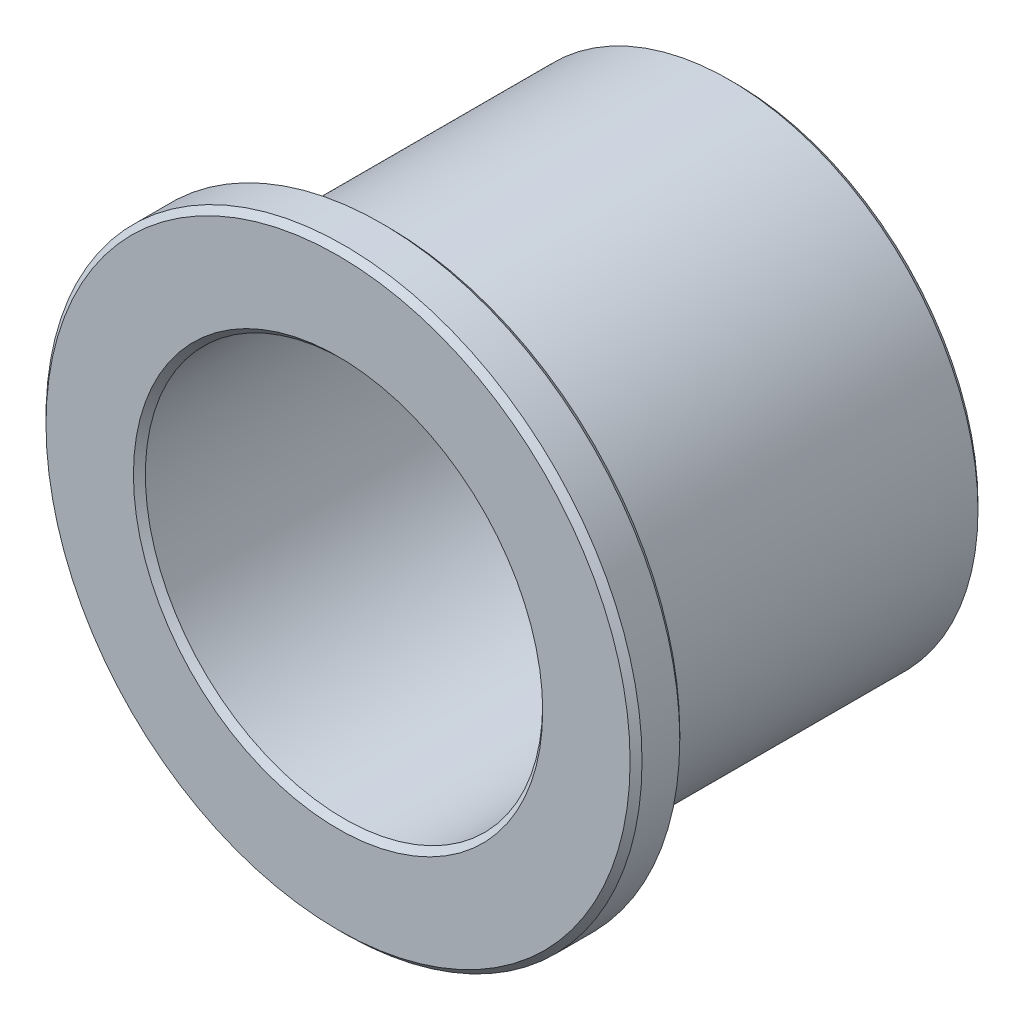
ISO-10303-21;
HEADER;
FILE_DESCRIPTION(('STEP AP214'),'2;1');
FILE_NAME('part.step','',(''),(''),'','','');
FILE_SCHEMA(('AUTOMOTIVE_DESIGN { 1 0 10303 214 1 1 1 1 }'));
ENDSEC;
DATA;
#1=APPLICATION_CONTEXT('core data for automotive mechanical design processes');
#2=APPLICATION_PROTOCOL_DEFINITION('international standard','automotive_design',2000,#1);
#3=PRODUCT_CONTEXT('',#1,'mechanical');
#4=PRODUCT('Part','Part','',(#3));
#5=PRODUCT_RELATED_PRODUCT_CATEGORY('part','',(#4));
#6=PRODUCT_DEFINITION_FORMATION('','',#4);
#7=PRODUCT_DEFINITION_CONTEXT('part definition',#1,'design');
#8=PRODUCT_DEFINITION('design','',#6,#7);
#9=PRODUCT_DEFINITION_SHAPE('','',#8);
#10=(LENGTH_UNIT() NAMED_UNIT(*) SI_UNIT(.MILLI.,.METRE.));
#11=(NAMED_UNIT(*) PLANE_ANGLE_UNIT() SI_UNIT($,.RADIAN.));
#12=(NAMED_UNIT(*) SI_UNIT($,.STERADIAN.) SOLID_ANGLE_UNIT());
#13=UNCERTAINTY_MEASURE_WITH_UNIT(LENGTH_MEASURE(1.E-05),#10,'distance_accuracy_value','');
#14=(GEOMETRIC_REPRESENTATION_CONTEXT(3) GLOBAL_UNCERTAINTY_ASSIGNED_CONTEXT((#13)) GLOBAL_UNIT_ASSIGNED_CONTEXT((#10,
#11,#12)) REPRESENTATION_CONTEXT('',''));
#15=CARTESIAN_POINT('',(0.,0.,0.));
#16=DIRECTION('',(0.,0.,1.));
#17=DIRECTION('',(1.,0.,0.));
#18=AXIS2_PLACEMENT_3D('',#15,#16,#17);
#19=CARTESIAN_POINT('',(0.,0.,9.52499999999999));
#20=DIRECTION('',(0.,0.,1.));
#21=DIRECTION('',(1.,0.,0.));
#22=AXIS2_PLACEMENT_3D('',#19,#20,#21);
#23=CYLINDRICAL_SURFACE('',#22,19.05);
#24=CARTESIAN_POINT('',(0.,0.,12.319));
#25=DIRECTION('',(0.,0.,1.));
#26=DIRECTION('',(1.,0.,0.));
#27=AXIS2_PLACEMENT_3D('',#24,#25,#26);
#28=CIRCLE('',#27,19.05);
#29=CARTESIAN_POINT('',(19.05,0.,12.319));
#30=VERTEX_POINT('',#29);
#31=EDGE_CURVE('E58',#30,#30,#28,.F.);
#32=ORIENTED_EDGE('',*,*,#31,.T.);
#33=EDGE_LOOP('',(#32));
#34=FACE_BOUND('',#33,.T.);
#35=CARTESIAN_POINT('',(0.,0.,9.90599999999999));
#36=DIRECTION('',(0.,0.,1.));
#37=DIRECTION('',(1.,0.,0.));
#38=AXIS2_PLACEMENT_3D('',#35,#36,#37);
#39=CIRCLE('',#38,19.05);
#40=CARTESIAN_POINT('',(19.05,0.,9.90599999999999));
#41=VERTEX_POINT('',#40);
#42=EDGE_CURVE('E61',#41,#41,#39,.T.);
#43=ORIENTED_EDGE('',*,*,#42,.T.);
#44=EDGE_LOOP('',(#43));
#45=FACE_BOUND('',#44,.T.);
#46=ADVANCED_FACE('F32',(#34,#45),#23,.T.);
#47=CARTESIAN_POINT('',(0.,0.,9.52499999999999));
#48=DIRECTION('',(0.,0.,1.));
#49=DIRECTION('',(1.,0.,0.));
#50=AXIS2_PLACEMENT_3D('',#47,#48,#49);
#51=PLANE('',#50);
#52=CARTESIAN_POINT('',(0.,0.,9.52499999999999));
#53=DIRECTION('',(0.,0.,1.));
#54=DIRECTION('',(1.,0.,0.));
#55=AXIS2_PLACEMENT_3D('',#52,#53,#54);
#56=CIRCLE('',#55,18.669);
#57=CARTESIAN_POINT('',(18.669,0.,9.52499999999999));
#58=VERTEX_POINT('',#57);
#59=EDGE_CURVE('E52',#58,#58,#56,.F.);
#60=ORIENTED_EDGE('',*,*,#59,.T.);
#61=EDGE_LOOP('',(#60));
#62=FACE_BOUND('',#61,.T.);
#63=CARTESIAN_POINT('',(0.,0.,9.52499999999999));
#64=DIRECTION('',(0.,0.,1.));
#65=DIRECTION('',(1.,0.,0.));
#66=AXIS2_PLACEMENT_3D('',#63,#64,#65);
#67=CIRCLE('',#66,16.2687);
#68=CARTESIAN_POINT('',(16.2687,0.,9.52499999999999));
#69=VERTEX_POINT('',#68);
#70=EDGE_CURVE('E55',#69,#69,#67,.T.);
#71=ORIENTED_EDGE('',*,*,#70,.T.);
#72=EDGE_LOOP('',(#71));
#73=FACE_BOUND('',#72,.T.);
#74=ADVANCED_FACE('F92',(#62,#73),#51,.F.);
#75=CARTESIAN_POINT('',(0.,0.,12.7));
#76=DIRECTION('',(0.,0.,1.));
#77=DIRECTION('',(1.,0.,0.));
#78=AXIS2_PLACEMENT_3D('',#75,#76,#77);
#79=PLANE('',#78);
#80=CARTESIAN_POINT('',(0.,0.,12.7));
#81=DIRECTION('',(0.,0.,1.));
#82=DIRECTION('',(1.,0.,0.));
#83=AXIS2_PLACEMENT_3D('',#80,#81,#82);
#84=CIRCLE('',#83,13.081);
#85=CARTESIAN_POINT('',(13.081,0.,12.7));
#86=VERTEX_POINT('',#85);
#87=EDGE_CURVE('E64',#86,#86,#84,.F.);
#88=ORIENTED_EDGE('',*,*,#87,.T.);
#89=EDGE_LOOP('',(#88));
#90=FACE_BOUND('',#89,.T.);
#91=CARTESIAN_POINT('',(0.,0.,12.7));
#92=DIRECTION('',(0.,0.,1.));
#93=DIRECTION('',(1.,0.,0.));
#94=AXIS2_PLACEMENT_3D('',#91,#92,#93);
#95=CIRCLE('',#94,18.669);
#96=CARTESIAN_POINT('',(18.669,0.,12.7));
#97=VERTEX_POINT('',#96);
#98=EDGE_CURVE('E67',#97,#97,#95,.T.);
#99=ORIENTED_EDGE('',*,*,#98,.T.);
#100=EDGE_LOOP('',(#99));
#101=FACE_BOUND('',#100,.T.);
#102=ADVANCED_FACE('F98',(#90,#101),#79,.T.);
#103=CARTESIAN_POINT('',(0.,0.,9.52499999999999));
#104=DIRECTION('',(0.,0.,1.));
#105=DIRECTION('',(1.,0.,0.));
#106=AXIS2_PLACEMENT_3D('',#103,#104,#105);
#107=CYLINDRICAL_SURFACE('',#106,12.7);
#108=CARTESIAN_POINT('',(0.,0.,12.319));
#109=DIRECTION('',(0.,0.,1.));
#110=DIRECTION('',(1.,0.,0.));
#111=AXIS2_PLACEMENT_3D('',#108,#109,#110);
#112=CIRCLE('',#111,12.7);
#113=CARTESIAN_POINT('',(12.7,0.,12.319));
#114=VERTEX_POINT('',#113);
#115=EDGE_CURVE('E70',#114,#114,#112,.T.);
#116=ORIENTED_EDGE('',*,*,#115,.T.);
#117=EDGE_LOOP('',(#116));
#118=FACE_BOUND('',#117,.T.);
#119=CARTESIAN_POINT('',(0.,0.,-12.319));
#120=DIRECTION('',(0.,0.,1.));
#121=DIRECTION('',(1.,0.,0.));
#122=AXIS2_PLACEMENT_3D('',#119,#120,#121);
#123=CIRCLE('',#122,12.7);
#124=CARTESIAN_POINT('',(12.7,0.,-12.319));
#125=VERTEX_POINT('',#124);
#126=EDGE_CURVE('E73',#125,#125,#123,.F.);
#127=ORIENTED_EDGE('',*,*,#126,.T.);
#128=EDGE_LOOP('',(#127));
#129=FACE_BOUND('',#128,.T.);
#130=ADVANCED_FACE('F77',(#118,#129),#107,.F.);
#131=CARTESIAN_POINT('',(0.,0.,-12.7));
#132=DIRECTION('',(0.,0.,1.));
#133=DIRECTION('',(1.,0.,0.));
#134=AXIS2_PLACEMENT_3D('',#131,#132,#133);
#135=CYLINDRICAL_SURFACE('',#134,15.8877);
#136=CARTESIAN_POINT('',(0.,0.,9.14399999999999));
#137=DIRECTION('',(0.,0.,1.));
#138=DIRECTION('',(1.,0.,0.));
#139=AXIS2_PLACEMENT_3D('',#136,#137,#138);
#140=CIRCLE('',#139,15.8877);
#141=CARTESIAN_POINT('',(15.8877,0.,9.14399999999999));
#142=VERTEX_POINT('',#141);
#143=EDGE_CURVE('E43',#142,#142,#140,.F.);
#144=ORIENTED_EDGE('',*,*,#143,.T.);
#145=EDGE_LOOP('',(#144));
#146=FACE_BOUND('',#145,.T.);
#147=CARTESIAN_POINT('',(0.,0.,-12.319));
#148=DIRECTION('',(0.,0.,1.));
#149=DIRECTION('',(1.,0.,0.));
#150=AXIS2_PLACEMENT_3D('',#147,#148,#149);
#151=CIRCLE('',#150,15.8877);
#152=CARTESIAN_POINT('',(15.8877,0.,-12.319));
#153=VERTEX_POINT('',#152);
#154=EDGE_CURVE('E47',#153,#153,#151,.T.);
#155=ORIENTED_EDGE('',*,*,#154,.T.);
#156=EDGE_LOOP('',(#155));
#157=FACE_BOUND('',#156,.T.);
#158=ADVANCED_FACE('F160',(#146,#157),#135,.T.);
#159=CARTESIAN_POINT('',(0.,0.,-12.7));
#160=DIRECTION('',(0.,0.,1.));
#161=DIRECTION('',(1.,0.,0.));
#162=AXIS2_PLACEMENT_3D('',#159,#160,#161);
#163=PLANE('',#162);
#164=CARTESIAN_POINT('',(0.,0.,-12.7));
#165=DIRECTION('',(0.,0.,1.));
#166=DIRECTION('',(1.,0.,0.));
#167=AXIS2_PLACEMENT_3D('',#164,#165,#166);
#168=CIRCLE('',#167,13.081);
#169=CARTESIAN_POINT('',(13.081,0.,-12.7));
#170=VERTEX_POINT('',#169);
#171=EDGE_CURVE('E10',#170,#170,#168,.T.);
#172=ORIENTED_EDGE('',*,*,#171,.T.);
#173=EDGE_LOOP('',(#172));
#174=FACE_BOUND('',#173,.T.);
#175=CARTESIAN_POINT('',(0.,0.,-12.7));
#176=DIRECTION('',(0.,0.,1.));
#177=DIRECTION('',(1.,0.,0.));
#178=AXIS2_PLACEMENT_3D('',#175,#176,#177);
#179=CIRCLE('',#178,15.5067);
#180=CARTESIAN_POINT('',(15.5067,0.,-12.7));
#181=VERTEX_POINT('',#180);
#182=EDGE_CURVE('E39',#181,#181,#179,.F.);
#183=ORIENTED_EDGE('',*,*,#182,.T.);
#184=EDGE_LOOP('',(#183));
#185=FACE_BOUND('',#184,.T.);
#186=ADVANCED_FACE('F108',(#174,#185),#163,.F.);
#187=CARTESIAN_POINT('',(0.,0.,12.319));
#188=DIRECTION('',(0.,0.,1.));
#189=DIRECTION('',(1.,0.,0.));
#190=AXIS2_PLACEMENT_3D('',#187,#188,#189);
#191=CONICAL_SURFACE('',#190,12.7,0.785398163397455);
#192=ORIENTED_EDGE('',*,*,#87,.F.);
#193=EDGE_LOOP('',(#192));
#194=FACE_BOUND('',#193,.T.);
#195=ORIENTED_EDGE('',*,*,#115,.F.);
#196=EDGE_LOOP('',(#195));
#197=FACE_BOUND('',#196,.T.);
#198=ADVANCED_FACE('F104',(#194,#197),#191,.F.);
#199=CARTESIAN_POINT('',(0.,0.,12.7));
#200=DIRECTION('',(0.,0.,-1.));
#201=DIRECTION('',(-1.,0.,0.));
#202=AXIS2_PLACEMENT_3D('',#199,#200,#201);
#203=CONICAL_SURFACE('',#202,18.669,0.785398163397453);
#204=ORIENTED_EDGE('',*,*,#31,.F.);
#205=EDGE_LOOP('',(#204));
#206=FACE_BOUND('',#205,.T.);
#207=ORIENTED_EDGE('',*,*,#98,.F.);
#208=EDGE_LOOP('',(#207));
#209=FACE_BOUND('',#208,.T.);
#210=ADVANCED_FACE('F107',(#206,#209),#203,.T.);
#211=CARTESIAN_POINT('',(0.,0.,9.90599999999999));
#212=DIRECTION('',(0.,0.,1.));
#213=DIRECTION('',(1.,0.,0.));
#214=AXIS2_PLACEMENT_3D('',#211,#212,#213);
#215=CONICAL_SURFACE('',#214,19.05,0.785398163397453);
#216=ORIENTED_EDGE('',*,*,#59,.F.);
#217=EDGE_LOOP('',(#216));
#218=FACE_BOUND('',#217,.T.);
#219=ORIENTED_EDGE('',*,*,#42,.F.);
#220=EDGE_LOOP('',(#219));
#221=FACE_BOUND('',#220,.T.);
#222=ADVANCED_FACE('F88',(#218,#221),#215,.T.);
#223=CARTESIAN_POINT('',(0.,0.,9.52499999999999));
#224=DIRECTION('',(0.,0.,1.));
#225=DIRECTION('',(1.,0.,0.));
#226=AXIS2_PLACEMENT_3D('',#223,#224,#225);
#227=CONICAL_SURFACE('',#226,16.2687,0.785398163397448);
#228=ORIENTED_EDGE('',*,*,#143,.F.);
#229=EDGE_LOOP('',(#228));
#230=FACE_BOUND('',#229,.T.);
#231=ORIENTED_EDGE('',*,*,#70,.F.);
#232=EDGE_LOOP('',(#231));
#233=FACE_BOUND('',#232,.T.);
#234=ADVANCED_FACE('F82',(#230,#233),#227,.T.);
#235=CARTESIAN_POINT('',(0.,0.,-12.7));
#236=DIRECTION('',(0.,0.,-1.));
#237=DIRECTION('',(-1.,0.,0.));
#238=AXIS2_PLACEMENT_3D('',#235,#236,#237);
#239=CONICAL_SURFACE('',#238,13.081,0.785398163397439);
#240=ORIENTED_EDGE('',*,*,#126,.F.);
#241=EDGE_LOOP('',(#240));
#242=FACE_BOUND('',#241,.T.);
#243=ORIENTED_EDGE('',*,*,#171,.F.);
#244=EDGE_LOOP('',(#243));
#245=FACE_BOUND('',#244,.T.);
#246=ADVANCED_FACE('F79',(#242,#245),#239,.F.);
#247=CARTESIAN_POINT('',(0.,0.,-12.319));
#248=DIRECTION('',(0.,0.,1.));
#249=DIRECTION('',(1.,0.,0.));
#250=AXIS2_PLACEMENT_3D('',#247,#248,#249);
#251=CONICAL_SURFACE('',#250,15.8877,0.785398163397457);
#252=ORIENTED_EDGE('',*,*,#182,.F.);
#253=EDGE_LOOP('',(#252));
#254=FACE_BOUND('',#253,.T.);
#255=ORIENTED_EDGE('',*,*,#154,.F.);
#256=EDGE_LOOP('',(#255));
#257=FACE_BOUND('',#256,.T.);
#258=ADVANCED_FACE('F34',(#254,#257),#251,.T.);
#259=CLOSED_SHELL('',(#46,#74,#102,#130,#158,#186,#198,#210,#222,#234,#246,#258));
#260=MANIFOLD_SOLID_BREP('B2',#259);
#261=ADVANCED_BREP_SHAPE_REPRESENTATION('',(#18,#260),#14);
#262=SHAPE_DEFINITION_REPRESENTATION(#9,#261);
ENDSEC;
END-ISO-10303-21;
